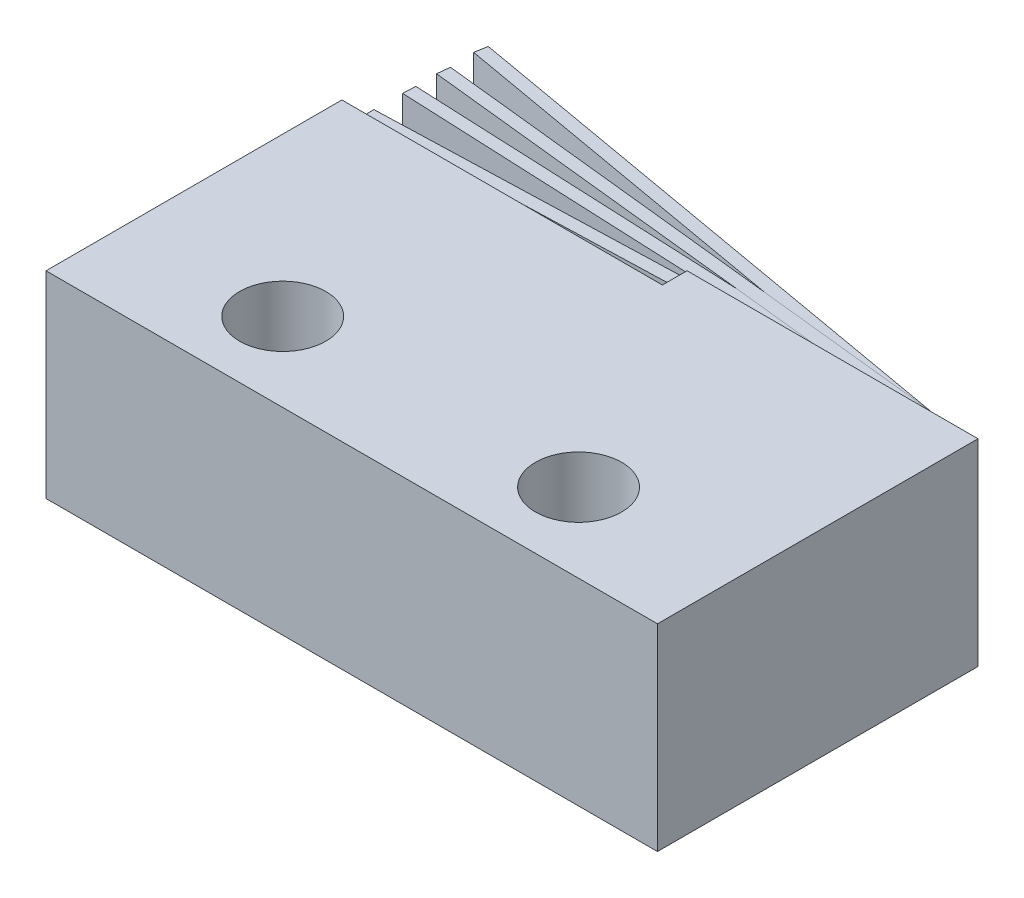
ISO-10303-21;
HEADER;
FILE_DESCRIPTION(('STEP AP214'),'2;1');
FILE_NAME('part.step','',(''),(''),'','','');
FILE_SCHEMA(('AUTOMOTIVE_DESIGN { 1 0 10303 214 1 1 1 1 }'));
ENDSEC;
DATA;
#1=APPLICATION_CONTEXT('core data for automotive mechanical design processes');
#2=APPLICATION_PROTOCOL_DEFINITION('international standard','automotive_design',2000,#1);
#3=PRODUCT_CONTEXT('',#1,'mechanical');
#4=PRODUCT('Part','Part','',(#3));
#5=PRODUCT_RELATED_PRODUCT_CATEGORY('part','',(#4));
#6=PRODUCT_DEFINITION_FORMATION('','',#4);
#7=PRODUCT_DEFINITION_CONTEXT('part definition',#1,'design');
#8=PRODUCT_DEFINITION('design','',#6,#7);
#9=PRODUCT_DEFINITION_SHAPE('','',#8);
#10=(LENGTH_UNIT() NAMED_UNIT(*) SI_UNIT(.MILLI.,.METRE.));
#11=(NAMED_UNIT(*) PLANE_ANGLE_UNIT() SI_UNIT($,.RADIAN.));
#12=(NAMED_UNIT(*) SI_UNIT($,.STERADIAN.) SOLID_ANGLE_UNIT());
#13=UNCERTAINTY_MEASURE_WITH_UNIT(LENGTH_MEASURE(1.E-05),#10,'distance_accuracy_value','');
#14=(GEOMETRIC_REPRESENTATION_CONTEXT(3) GLOBAL_UNCERTAINTY_ASSIGNED_CONTEXT((#13)) GLOBAL_UNIT_ASSIGNED_CONTEXT((#10,
#11,#12)) REPRESENTATION_CONTEXT('',''));
#15=CARTESIAN_POINT('',(0.,0.,0.));
#16=DIRECTION('',(0.,0.,1.));
#17=DIRECTION('',(1.,0.,0.));
#18=AXIS2_PLACEMENT_3D('',#15,#16,#17);
#19=CARTESIAN_POINT('',(-2.38125,1.5875,-10.715625));
#20=DIRECTION('',(0.999484869317121,0.,-0.032093550849632));
#21=DIRECTION('',(-0.032093550849632,0.,-0.999484869317121));
#22=AXIS2_PLACEMENT_3D('',#19,#20,#21);
#23=PLANE('',#22);
#24=DIRECTION('',(-0.032093550849632,0.,-0.999484869317121));
#25=VECTOR('',#24,1.);
#26=CARTESIAN_POINT('',(-2.38125,5.55625,-10.715625));
#27=LINE('',#26,#25);
#28=CARTESIAN_POINT('',(-2.38125,5.55625,-10.715625));
#29=VERTEX_POINT('',#28);
#30=CARTESIAN_POINT('',(-2.39429281906529,5.55625,-11.1218156508905));
#31=VERTEX_POINT('',#30);
#32=EDGE_CURVE('E411',#29,#31,#27,.T.);
#33=ORIENTED_EDGE('',*,*,#32,.F.);
#34=DIRECTION('',(0.,1.,0.));
#35=VECTOR('',#34,1.);
#36=CARTESIAN_POINT('',(-2.38125,1.5875,-10.715625));
#37=LINE('',#36,#35);
#38=CARTESIAN_POINT('',(-2.38125,1.5875,-10.715625));
#39=VERTEX_POINT('',#38);
#40=EDGE_CURVE('E12',#39,#29,#37,.T.);
#41=ORIENTED_EDGE('',*,*,#40,.F.);
#42=DIRECTION('',(-0.032093550849632,0.,-0.999484869317121));
#43=VECTOR('',#42,1.);
#44=CARTESIAN_POINT('',(-2.38125,1.5875,-10.715625));
#45=LINE('',#44,#43);
#46=CARTESIAN_POINT('',(-2.39429281906529,1.5875,-11.1218156508905));
#47=VERTEX_POINT('',#46);
#48=EDGE_CURVE('E413',#39,#47,#45,.T.);
#49=ORIENTED_EDGE('',*,*,#48,.T.);
#50=DIRECTION('',(0.,1.,0.));
#51=VECTOR('',#50,1.);
#52=CARTESIAN_POINT('',(-2.39429281906529,1.5875,-11.1218156508905));
#53=LINE('',#52,#51);
#54=EDGE_CURVE('E374',#47,#31,#53,.T.);
#55=ORIENTED_EDGE('',*,*,#54,.T.);
#56=EDGE_LOOP('',(#33,#41,#49,#55));
#57=FACE_BOUND('',#56,.T.);
#58=ADVANCED_FACE('F371',(#57),#23,.T.);
#59=CARTESIAN_POINT('',(-2.38125,1.5875,-10.715625));
#60=DIRECTION('',(0.0320935508496321,0.,0.999484869317121));
#61=DIRECTION('',(0.999484869317121,0.,-0.0320935508496321));
#62=AXIS2_PLACEMENT_3D('',#59,#60,#61);
#63=PLANE('',#62);
#64=DIRECTION('',(0.999484869317121,0.,-0.032093550849632));
#65=VECTOR('',#64,1.);
#66=CARTESIAN_POINT('',(-2.38125,5.55625,-10.715625));
#67=LINE('',#66,#65);
#68=CARTESIAN_POINT('',(-19.685,5.55625,-10.16));
#69=VERTEX_POINT('',#68);
#70=EDGE_CURVE('E428',#69,#29,#67,.T.);
#71=ORIENTED_EDGE('',*,*,#70,.F.);
#72=DIRECTION('',(0.,1.,0.));
#73=VECTOR('',#72,1.);
#74=CARTESIAN_POINT('',(-19.685,1.5875,-10.16));
#75=LINE('',#74,#73);
#76=CARTESIAN_POINT('',(-19.685,1.5875,-10.16));
#77=VERTEX_POINT('',#76);
#78=EDGE_CURVE('E379',#77,#69,#75,.T.);
#79=ORIENTED_EDGE('',*,*,#78,.F.);
#80=DIRECTION('',(0.999484869317121,0.,-0.032093550849632));
#81=VECTOR('',#80,1.);
#82=CARTESIAN_POINT('',(-2.38125,1.5875,-10.715625));
#83=LINE('',#82,#81);
#84=EDGE_CURVE('E418',#77,#39,#83,.T.);
#85=ORIENTED_EDGE('',*,*,#84,.T.);
#86=ORIENTED_EDGE('',*,*,#40,.T.);
#87=EDGE_LOOP('',(#71,#79,#85,#86));
#88=FACE_BOUND('',#87,.T.);
#89=ADVANCED_FACE('F443',(#88),#63,.T.);
#90=CARTESIAN_POINT('',(-19.685,1.5875,-10.16));
#91=DIRECTION('',(-0.999484869317121,0.,0.0320935508496286));
#92=DIRECTION('',(0.0320935508496286,0.,0.999484869317121));
#93=AXIS2_PLACEMENT_3D('',#90,#91,#92);
#94=PLANE('',#93);
#95=DIRECTION('',(0.0320935508496286,0.,0.999484869317121));
#96=VECTOR('',#95,1.);
#97=CARTESIAN_POINT('',(-19.685,5.55625,-10.16));
#98=LINE('',#97,#96);
#99=CARTESIAN_POINT('',(-19.6980428190653,5.55625,-10.5661906508905));
#100=VERTEX_POINT('',#99);
#101=EDGE_CURVE('E425',#100,#69,#98,.T.);
#102=ORIENTED_EDGE('',*,*,#101,.F.);
#103=DIRECTION('',(0.,1.,0.));
#104=VECTOR('',#103,1.);
#105=CARTESIAN_POINT('',(-19.6980428190653,1.5875,-10.5661906508905));
#106=LINE('',#105,#104);
#107=CARTESIAN_POINT('',(-19.6980428190653,1.5875,-10.5661906508905));
#108=VERTEX_POINT('',#107);
#109=EDGE_CURVE('E417',#108,#100,#106,.T.);
#110=ORIENTED_EDGE('',*,*,#109,.F.);
#111=DIRECTION('',(0.0320935508496286,0.,0.999484869317121));
#112=VECTOR('',#111,1.);
#113=CARTESIAN_POINT('',(-19.685,1.5875,-10.16));
#114=LINE('',#113,#112);
#115=EDGE_CURVE('E436',#108,#77,#114,.T.);
#116=ORIENTED_EDGE('',*,*,#115,.T.);
#117=ORIENTED_EDGE('',*,*,#78,.T.);
#118=EDGE_LOOP('',(#102,#110,#116,#117));
#119=FACE_BOUND('',#118,.T.);
#120=ADVANCED_FACE('F440',(#119),#94,.T.);
#121=CARTESIAN_POINT('',(-2.39429281906529,1.5875,-11.1218156508905));
#122=DIRECTION('',(-0.0320935508496319,0.,-0.999484869317121));
#123=DIRECTION('',(-0.999484869317121,0.,0.0320935508496319));
#124=AXIS2_PLACEMENT_3D('',#121,#122,#123);
#125=PLANE('',#124);
#126=DIRECTION('',(-0.999484869317121,0.,0.0320935508496319));
#127=VECTOR('',#126,1.);
#128=CARTESIAN_POINT('',(-2.39429281906529,5.55625,-11.1218156508905));
#129=LINE('',#128,#127);
#130=EDGE_CURVE('E420',#31,#100,#129,.T.);
#131=ORIENTED_EDGE('',*,*,#130,.F.);
#132=ORIENTED_EDGE('',*,*,#54,.F.);
#133=DIRECTION('',(-0.999484869317121,0.,0.0320935508496319));
#134=VECTOR('',#133,1.);
#135=CARTESIAN_POINT('',(-2.39429281906529,1.5875,-11.1218156508905));
#136=LINE('',#135,#134);
#137=EDGE_CURVE('E434',#47,#108,#136,.T.);
#138=ORIENTED_EDGE('',*,*,#137,.T.);
#139=ORIENTED_EDGE('',*,*,#109,.T.);
#140=EDGE_LOOP('',(#131,#132,#138,#139));
#141=FACE_BOUND('',#140,.T.);
#142=ADVANCED_FACE('F421',(#141),#125,.T.);
#143=CARTESIAN_POINT('',(-2.39429281906529,1.5875,-11.1218156508905));
#144=DIRECTION('',(0.,1.,0.));
#145=DIRECTION('',(0.,0.,1.));
#146=AXIS2_PLACEMENT_3D('',#143,#144,#145);
#147=PLANE('',#146);
#148=ORIENTED_EDGE('',*,*,#48,.F.);
#149=ORIENTED_EDGE('',*,*,#84,.F.);
#150=ORIENTED_EDGE('',*,*,#115,.F.);
#151=ORIENTED_EDGE('',*,*,#137,.F.);
#152=EDGE_LOOP('',(#148,#149,#150,#151));
#153=FACE_BOUND('',#152,.T.);
#154=ADVANCED_FACE('F445',(#153),#147,.F.);
#155=CARTESIAN_POINT('',(-2.39429281906529,5.55625,-11.1218156508905));
#156=DIRECTION('',(0.,1.,0.));
#157=DIRECTION('',(0.,0.,1.));
#158=AXIS2_PLACEMENT_3D('',#155,#156,#157);
#159=PLANE('',#158);
#160=ORIENTED_EDGE('',*,*,#32,.T.);
#161=ORIENTED_EDGE('',*,*,#130,.T.);
#162=ORIENTED_EDGE('',*,*,#101,.T.);
#163=ORIENTED_EDGE('',*,*,#70,.T.);
#164=EDGE_LOOP('',(#160,#161,#162,#163));
#165=FACE_BOUND('',#164,.T.);
#166=ADVANCED_FACE('F427',(#165),#159,.T.);
#167=CLOSED_SHELL('',(#58,#89,#120,#142,#154,#166));
#168=MANIFOLD_SOLID_BREP('B2',#167);
#169=CARTESIAN_POINT('',(-2.38125,1.5875,-10.715625));
#170=DIRECTION('',(0.994288429664584,0.,0.106726372725466));
#171=DIRECTION('',(0.106726372725466,0.,-0.994288429664584));
#172=AXIS2_PLACEMENT_3D('',#169,#170,#171);
#173=PLANE('',#172);
#174=DIRECTION('',(0.106726372725466,0.,-0.994288429664584));
#175=VECTOR('',#174,1.);
#176=CARTESIAN_POINT('',(-2.38125,5.55625,-10.715625));
#177=LINE('',#176,#175);
#178=CARTESIAN_POINT('',(-2.38125,5.55625,-10.715625));
#179=VERTEX_POINT('',#178);
#180=CARTESIAN_POINT('',(-2.33787640212437,5.55625,-11.1197038178157));
#181=VERTEX_POINT('',#180);
#182=EDGE_CURVE('E532',#179,#181,#177,.T.);
#183=ORIENTED_EDGE('',*,*,#182,.F.);
#184=DIRECTION('',(0.,1.,0.));
#185=VECTOR('',#184,1.);
#186=CARTESIAN_POINT('',(-2.38125,1.5875,-10.715625));
#187=LINE('',#186,#185);
#188=CARTESIAN_POINT('',(-2.38125,1.5875,-10.715625));
#189=VERTEX_POINT('',#188);
#190=EDGE_CURVE('E369',#189,#179,#187,.T.);
#191=ORIENTED_EDGE('',*,*,#190,.F.);
#192=DIRECTION('',(0.106726372725466,0.,-0.994288429664584));
#193=VECTOR('',#192,1.);
#194=CARTESIAN_POINT('',(-2.38125,1.5875,-10.715625));
#195=LINE('',#194,#193);
#196=CARTESIAN_POINT('',(-2.33787640212437,1.5875,-11.1197038178157));
#197=VERTEX_POINT('',#196);
#198=EDGE_CURVE('E534',#189,#197,#195,.T.);
#199=ORIENTED_EDGE('',*,*,#198,.T.);
#200=DIRECTION('',(0.,1.,0.));
#201=VECTOR('',#200,1.);
#202=CARTESIAN_POINT('',(-2.33787640212437,1.5875,-11.1197038178157));
#203=LINE('',#202,#201);
#204=EDGE_CURVE('E495',#197,#181,#203,.T.);
#205=ORIENTED_EDGE('',*,*,#204,.T.);
#206=EDGE_LOOP('',(#183,#191,#199,#205));
#207=FACE_BOUND('',#206,.T.);
#208=ADVANCED_FACE('F492',(#207),#173,.T.);
#209=CARTESIAN_POINT('',(-2.38125,1.5875,-10.715625));
#210=DIRECTION('',(-0.106726372725465,0.,0.994288429664584));
#211=DIRECTION('',(0.994288429664585,0.,0.106726372725465));
#212=AXIS2_PLACEMENT_3D('',#209,#210,#211);
#213=PLANE('',#212);
#214=DIRECTION('',(0.994288429664584,0.,0.106726372725465));
#215=VECTOR('',#214,1.);
#216=CARTESIAN_POINT('',(-2.38125,5.55625,-10.715625));
#217=LINE('',#216,#215);
#218=CARTESIAN_POINT('',(-19.685,5.55625,-12.573));
#219=VERTEX_POINT('',#218);
#220=EDGE_CURVE('E549',#219,#179,#217,.T.);
#221=ORIENTED_EDGE('',*,*,#220,.F.);
#222=DIRECTION('',(0.,1.,0.));
#223=VECTOR('',#222,1.);
#224=CARTESIAN_POINT('',(-19.685,1.5875,-12.573));
#225=LINE('',#224,#223);
#226=CARTESIAN_POINT('',(-19.685,1.5875,-12.573));
#227=VERTEX_POINT('',#226);
#228=EDGE_CURVE('E500',#227,#219,#225,.T.);
#229=ORIENTED_EDGE('',*,*,#228,.F.);
#230=DIRECTION('',(0.994288429664584,0.,0.106726372725465));
#231=VECTOR('',#230,1.);
#232=CARTESIAN_POINT('',(-2.38125,1.5875,-10.715625));
#233=LINE('',#232,#231);
#234=EDGE_CURVE('E539',#227,#189,#233,.T.);
#235=ORIENTED_EDGE('',*,*,#234,.T.);
#236=ORIENTED_EDGE('',*,*,#190,.T.);
#237=EDGE_LOOP('',(#221,#229,#235,#236));
#238=FACE_BOUND('',#237,.T.);
#239=ADVANCED_FACE('F564',(#238),#213,.T.);
#240=CARTESIAN_POINT('',(-19.685,1.5875,-12.573));
#241=DIRECTION('',(-0.994288429664584,0.,-0.106726372725468));
#242=DIRECTION('',(-0.106726372725468,0.,0.994288429664584));
#243=AXIS2_PLACEMENT_3D('',#240,#241,#242);
#244=PLANE('',#243);
#245=DIRECTION('',(-0.106726372725468,0.,0.994288429664584));
#246=VECTOR('',#245,1.);
#247=CARTESIAN_POINT('',(-19.685,5.55625,-12.573));
#248=LINE('',#247,#246);
#249=CARTESIAN_POINT('',(-19.6416264021244,5.55625,-12.9770788178157));
#250=VERTEX_POINT('',#249);
#251=EDGE_CURVE('E546',#250,#219,#248,.T.);
#252=ORIENTED_EDGE('',*,*,#251,.F.);
#253=DIRECTION('',(0.,1.,0.));
#254=VECTOR('',#253,1.);
#255=CARTESIAN_POINT('',(-19.6416264021244,1.5875,-12.9770788178157));
#256=LINE('',#255,#254);
#257=CARTESIAN_POINT('',(-19.6416264021244,1.5875,-12.9770788178157));
#258=VERTEX_POINT('',#257);
#259=EDGE_CURVE('E538',#258,#250,#256,.T.);
#260=ORIENTED_EDGE('',*,*,#259,.F.);
#261=DIRECTION('',(-0.106726372725468,0.,0.994288429664584));
#262=VECTOR('',#261,1.);
#263=CARTESIAN_POINT('',(-19.685,1.5875,-12.573));
#264=LINE('',#263,#262);
#265=EDGE_CURVE('E557',#258,#227,#264,.T.);
#266=ORIENTED_EDGE('',*,*,#265,.T.);
#267=ORIENTED_EDGE('',*,*,#228,.T.);
#268=EDGE_LOOP('',(#252,#260,#266,#267));
#269=FACE_BOUND('',#268,.T.);
#270=ADVANCED_FACE('F561',(#269),#244,.T.);
#271=CARTESIAN_POINT('',(-2.33787640212437,1.5875,-11.1197038178157));
#272=DIRECTION('',(0.106726372725465,0.,-0.994288429664584));
#273=DIRECTION('',(-0.994288429664585,0.,-0.106726372725465));
#274=AXIS2_PLACEMENT_3D('',#271,#272,#273);
#275=PLANE('',#274);
#276=DIRECTION('',(-0.994288429664584,0.,-0.106726372725465));
#277=VECTOR('',#276,1.);
#278=CARTESIAN_POINT('',(-2.33787640212437,5.55625,-11.1197038178157));
#279=LINE('',#278,#277);
#280=EDGE_CURVE('E541',#181,#250,#279,.T.);
#281=ORIENTED_EDGE('',*,*,#280,.F.);
#282=ORIENTED_EDGE('',*,*,#204,.F.);
#283=DIRECTION('',(-0.994288429664584,0.,-0.106726372725465));
#284=VECTOR('',#283,1.);
#285=CARTESIAN_POINT('',(-2.33787640212437,1.5875,-11.1197038178157));
#286=LINE('',#285,#284);
#287=EDGE_CURVE('E555',#197,#258,#286,.T.);
#288=ORIENTED_EDGE('',*,*,#287,.T.);
#289=ORIENTED_EDGE('',*,*,#259,.T.);
#290=EDGE_LOOP('',(#281,#282,#288,#289));
#291=FACE_BOUND('',#290,.T.);
#292=ADVANCED_FACE('F542',(#291),#275,.T.);
#293=CARTESIAN_POINT('',(-2.33787640212437,1.5875,-11.1197038178157));
#294=DIRECTION('',(0.,1.,0.));
#295=DIRECTION('',(0.,0.,1.));
#296=AXIS2_PLACEMENT_3D('',#293,#294,#295);
#297=PLANE('',#296);
#298=ORIENTED_EDGE('',*,*,#198,.F.);
#299=ORIENTED_EDGE('',*,*,#234,.F.);
#300=ORIENTED_EDGE('',*,*,#265,.F.);
#301=ORIENTED_EDGE('',*,*,#287,.F.);
#302=EDGE_LOOP('',(#298,#299,#300,#301));
#303=FACE_BOUND('',#302,.T.);
#304=ADVANCED_FACE('F566',(#303),#297,.F.);
#305=CARTESIAN_POINT('',(-2.33787640212437,5.55625,-11.1197038178157));
#306=DIRECTION('',(0.,1.,0.));
#307=DIRECTION('',(0.,0.,1.));
#308=AXIS2_PLACEMENT_3D('',#305,#306,#307);
#309=PLANE('',#308);
#310=ORIENTED_EDGE('',*,*,#182,.T.);
#311=ORIENTED_EDGE('',*,*,#280,.T.);
#312=ORIENTED_EDGE('',*,*,#251,.T.);
#313=ORIENTED_EDGE('',*,*,#220,.T.);
#314=EDGE_LOOP('',(#310,#311,#312,#313));
#315=FACE_BOUND('',#314,.T.);
#316=ADVANCED_FACE('F548',(#315),#309,.T.);
#317=CLOSED_SHELL('',(#208,#239,#270,#292,#304,#316));
#318=MANIFOLD_SOLID_BREP('B6',#317);
#319=CARTESIAN_POINT('',(-2.38125,1.5875,-10.715625));
#320=DIRECTION('',(0.999023719235725,0.,0.0441770121717087));
#321=DIRECTION('',(0.0441770121717087,0.,-0.999023719235725));
#322=AXIS2_PLACEMENT_3D('',#319,#320,#321);
#323=PLANE('',#322);
#324=DIRECTION('',(0.0441770121717087,0.,-0.999023719235725));
#325=VECTOR('',#324,1.);
#326=CARTESIAN_POINT('',(-2.38125,5.55625,-10.715625));
#327=LINE('',#326,#325);
#328=CARTESIAN_POINT('',(-2.38125,5.55625,-10.715625));
#329=VERTEX_POINT('',#328);
#330=CARTESIAN_POINT('',(-2.36329646225342,5.55625,-11.1216282394974));
#331=VERTEX_POINT('',#330);
#332=EDGE_CURVE('E653',#329,#331,#327,.T.);
#333=ORIENTED_EDGE('',*,*,#332,.F.);
#334=DIRECTION('',(0.,1.,0.));
#335=VECTOR('',#334,1.);
#336=CARTESIAN_POINT('',(-2.38125,1.5875,-10.715625));
#337=LINE('',#336,#335);
#338=CARTESIAN_POINT('',(-2.38125,1.5875,-10.715625));
#339=VERTEX_POINT('',#338);
#340=EDGE_CURVE('E490',#339,#329,#337,.T.);
#341=ORIENTED_EDGE('',*,*,#340,.F.);
#342=DIRECTION('',(0.0441770121717087,0.,-0.999023719235725));
#343=VECTOR('',#342,1.);
#344=CARTESIAN_POINT('',(-2.38125,1.5875,-10.715625));
#345=LINE('',#344,#343);
#346=CARTESIAN_POINT('',(-2.36329646225342,1.5875,-11.1216282394974));
#347=VERTEX_POINT('',#346);
#348=EDGE_CURVE('E655',#339,#347,#345,.T.);
#349=ORIENTED_EDGE('',*,*,#348,.T.);
#350=DIRECTION('',(0.,1.,0.));
#351=VECTOR('',#350,1.);
#352=CARTESIAN_POINT('',(-2.36329646225342,1.5875,-11.1216282394974));
#353=LINE('',#352,#351);
#354=EDGE_CURVE('E616',#347,#331,#353,.T.);
#355=ORIENTED_EDGE('',*,*,#354,.T.);
#356=EDGE_LOOP('',(#333,#341,#349,#355));
#357=FACE_BOUND('',#356,.T.);
#358=ADVANCED_FACE('F613',(#357),#323,.T.);
#359=CARTESIAN_POINT('',(-2.38125,1.5875,-10.715625));
#360=DIRECTION('',(-0.0441770121717084,0.,0.999023719235725));
#361=DIRECTION('',(0.999023719235725,0.,0.0441770121717084));
#362=AXIS2_PLACEMENT_3D('',#359,#360,#361);
#363=PLANE('',#362);
#364=DIRECTION('',(0.999023719235725,0.,0.0441770121717084));
#365=VECTOR('',#364,1.);
#366=CARTESIAN_POINT('',(-2.38125,5.55625,-10.715625));
#367=LINE('',#366,#365);
#368=CARTESIAN_POINT('',(-19.685,5.55625,-11.4808));
#369=VERTEX_POINT('',#368);
#370=EDGE_CURVE('E670',#369,#329,#367,.T.);
#371=ORIENTED_EDGE('',*,*,#370,.F.);
#372=DIRECTION('',(0.,1.,0.));
#373=VECTOR('',#372,1.);
#374=CARTESIAN_POINT('',(-19.685,1.5875,-11.4808));
#375=LINE('',#374,#373);
#376=CARTESIAN_POINT('',(-19.685,1.5875,-11.4808));
#377=VERTEX_POINT('',#376);
#378=EDGE_CURVE('E621',#377,#369,#375,.T.);
#379=ORIENTED_EDGE('',*,*,#378,.F.);
#380=DIRECTION('',(0.999023719235725,0.,0.0441770121717084));
#381=VECTOR('',#380,1.);
#382=CARTESIAN_POINT('',(-2.38125,1.5875,-10.715625));
#383=LINE('',#382,#381);
#384=EDGE_CURVE('E660',#377,#339,#383,.T.);
#385=ORIENTED_EDGE('',*,*,#384,.T.);
#386=ORIENTED_EDGE('',*,*,#340,.T.);
#387=EDGE_LOOP('',(#371,#379,#385,#386));
#388=FACE_BOUND('',#387,.T.);
#389=ADVANCED_FACE('F685',(#388),#363,.T.);
#390=CARTESIAN_POINT('',(-19.685,1.5875,-11.4808));
#391=DIRECTION('',(-0.999023719235725,0.,-0.0441770121717053));
#392=DIRECTION('',(-0.0441770121717053,0.,0.999023719235725));
#393=AXIS2_PLACEMENT_3D('',#390,#391,#392);
#394=PLANE('',#393);
#395=DIRECTION('',(-0.0441770121717053,0.,0.999023719235725));
#396=VECTOR('',#395,1.);
#397=CARTESIAN_POINT('',(-19.685,5.55625,-11.4808));
#398=LINE('',#397,#396);
#399=CARTESIAN_POINT('',(-19.6670464622534,5.55625,-11.8868032394974));
#400=VERTEX_POINT('',#399);
#401=EDGE_CURVE('E667',#400,#369,#398,.T.);
#402=ORIENTED_EDGE('',*,*,#401,.F.);
#403=DIRECTION('',(0.,1.,0.));
#404=VECTOR('',#403,1.);
#405=CARTESIAN_POINT('',(-19.6670464622534,1.5875,-11.8868032394974));
#406=LINE('',#405,#404);
#407=CARTESIAN_POINT('',(-19.6670464622534,1.5875,-11.8868032394974));
#408=VERTEX_POINT('',#407);
#409=EDGE_CURVE('E659',#408,#400,#406,.T.);
#410=ORIENTED_EDGE('',*,*,#409,.F.);
#411=DIRECTION('',(-0.0441770121717053,0.,0.999023719235725));
#412=VECTOR('',#411,1.);
#413=CARTESIAN_POINT('',(-19.685,1.5875,-11.4808));
#414=LINE('',#413,#412);
#415=EDGE_CURVE('E678',#408,#377,#414,.T.);
#416=ORIENTED_EDGE('',*,*,#415,.T.);
#417=ORIENTED_EDGE('',*,*,#378,.T.);
#418=EDGE_LOOP('',(#402,#410,#416,#417));
#419=FACE_BOUND('',#418,.T.);
#420=ADVANCED_FACE('F682',(#419),#394,.T.);
#421=CARTESIAN_POINT('',(-2.36329646225342,1.5875,-11.1216282394974));
#422=DIRECTION('',(0.0441770121717085,0.,-0.999023719235725));
#423=DIRECTION('',(-0.999023719235725,0.,-0.0441770121717085));
#424=AXIS2_PLACEMENT_3D('',#421,#422,#423);
#425=PLANE('',#424);
#426=DIRECTION('',(-0.999023719235725,0.,-0.0441770121717085));
#427=VECTOR('',#426,1.);
#428=CARTESIAN_POINT('',(-2.36329646225342,5.55625,-11.1216282394974));
#429=LINE('',#428,#427);
#430=EDGE_CURVE('E662',#331,#400,#429,.T.);
#431=ORIENTED_EDGE('',*,*,#430,.F.);
#432=ORIENTED_EDGE('',*,*,#354,.F.);
#433=DIRECTION('',(-0.999023719235725,0.,-0.0441770121717085));
#434=VECTOR('',#433,1.);
#435=CARTESIAN_POINT('',(-2.36329646225342,1.5875,-11.1216282394974));
#436=LINE('',#435,#434);
#437=EDGE_CURVE('E676',#347,#408,#436,.T.);
#438=ORIENTED_EDGE('',*,*,#437,.T.);
#439=ORIENTED_EDGE('',*,*,#409,.T.);
#440=EDGE_LOOP('',(#431,#432,#438,#439));
#441=FACE_BOUND('',#440,.T.);
#442=ADVANCED_FACE('F663',(#441),#425,.T.);
#443=CARTESIAN_POINT('',(-2.36329646225342,1.5875,-11.1216282394974));
#444=DIRECTION('',(0.,1.,0.));
#445=DIRECTION('',(0.,0.,1.));
#446=AXIS2_PLACEMENT_3D('',#443,#444,#445);
#447=PLANE('',#446);
#448=ORIENTED_EDGE('',*,*,#348,.F.);
#449=ORIENTED_EDGE('',*,*,#384,.F.);
#450=ORIENTED_EDGE('',*,*,#415,.F.);
#451=ORIENTED_EDGE('',*,*,#437,.F.);
#452=EDGE_LOOP('',(#448,#449,#450,#451));
#453=FACE_BOUND('',#452,.T.);
#454=ADVANCED_FACE('F687',(#453),#447,.F.);
#455=CARTESIAN_POINT('',(-2.36329646225342,5.55625,-11.1216282394974));
#456=DIRECTION('',(0.,1.,0.));
#457=DIRECTION('',(0.,0.,1.));
#458=AXIS2_PLACEMENT_3D('',#455,#456,#457);
#459=PLANE('',#458);
#460=ORIENTED_EDGE('',*,*,#332,.T.);
#461=ORIENTED_EDGE('',*,*,#430,.T.);
#462=ORIENTED_EDGE('',*,*,#401,.T.);
#463=ORIENTED_EDGE('',*,*,#370,.T.);
#464=EDGE_LOOP('',(#460,#461,#462,#463));
#465=FACE_BOUND('',#464,.T.);
#466=ADVANCED_FACE('F669',(#465),#459,.T.);
#467=CLOSED_SHELL('',(#358,#389,#420,#442,#454,#466));
#468=MANIFOLD_SOLID_BREP('B363',#467);
#469=CARTESIAN_POINT('',(-2.38125,1.5875,-10.715625));
#470=DIRECTION('',(0.984807198170495,0.,0.173651324301256));
#471=DIRECTION('',(0.173651324301256,0.,-0.984807198170495));
#472=AXIS2_PLACEMENT_3D('',#469,#470,#471);
#473=PLANE('',#472);
#474=DIRECTION('',(0.173651324301256,0.,-0.984807198170495));
#475=VECTOR('',#474,1.);
#476=CARTESIAN_POINT('',(-2.38125,5.55625,-10.715625));
#477=LINE('',#476,#475);
#478=CARTESIAN_POINT('',(-2.38125,5.55625,-10.715625));
#479=VERTEX_POINT('',#478);
#480=CARTESIAN_POINT('',(-2.31067810180397,5.55625,-11.1158506453365));
#481=VERTEX_POINT('',#480);
#482=EDGE_CURVE('E773',#479,#481,#477,.T.);
#483=ORIENTED_EDGE('',*,*,#482,.F.);
#484=DIRECTION('',(0.,1.,0.));
#485=VECTOR('',#484,1.);
#486=CARTESIAN_POINT('',(-2.38125,1.5875,-10.715625));
#487=LINE('',#486,#485);
#488=CARTESIAN_POINT('',(-2.38125,1.5875,-10.715625));
#489=VERTEX_POINT('',#488);
#490=EDGE_CURVE('E611',#489,#479,#487,.T.);
#491=ORIENTED_EDGE('',*,*,#490,.F.);
#492=DIRECTION('',(0.173651324301256,0.,-0.984807198170495));
#493=VECTOR('',#492,1.);
#494=CARTESIAN_POINT('',(-2.38125,1.5875,-10.715625));
#495=LINE('',#494,#493);
#496=CARTESIAN_POINT('',(-2.31067810180397,1.5875,-11.1158506453365));
#497=VERTEX_POINT('',#496);
#498=EDGE_CURVE('E775',#489,#497,#495,.T.);
#499=ORIENTED_EDGE('',*,*,#498,.T.);
#500=DIRECTION('',(0.,1.,0.));
#501=VECTOR('',#500,1.);
#502=CARTESIAN_POINT('',(-2.31067810180397,1.5875,-11.1158506453365));
#503=LINE('',#502,#501);
#504=EDGE_CURVE('E736',#497,#481,#503,.T.);
#505=ORIENTED_EDGE('',*,*,#504,.T.);
#506=EDGE_LOOP('',(#483,#491,#499,#505));
#507=FACE_BOUND('',#506,.T.);
#508=ADVANCED_FACE('F733',(#507),#473,.T.);
#509=CARTESIAN_POINT('',(-2.38125,1.5875,-10.715625));
#510=DIRECTION('',(-0.173651324301256,0.,0.984807198170495));
#511=DIRECTION('',(0.984807198170495,0.,0.173651324301256));
#512=AXIS2_PLACEMENT_3D('',#509,#510,#511);
#513=PLANE('',#512);
#514=DIRECTION('',(0.984807198170495,0.,0.173651324301256));
#515=VECTOR('',#514,1.);
#516=CARTESIAN_POINT('',(-2.38125,5.55625,-10.715625));
#517=LINE('',#516,#515);
#518=CARTESIAN_POINT('',(-19.685,5.55625,-13.7668));
#519=VERTEX_POINT('',#518);
#520=EDGE_CURVE('E790',#519,#479,#517,.T.);
#521=ORIENTED_EDGE('',*,*,#520,.F.);
#522=DIRECTION('',(0.,1.,0.));
#523=VECTOR('',#522,1.);
#524=CARTESIAN_POINT('',(-19.685,1.5875,-13.7668));
#525=LINE('',#524,#523);
#526=CARTESIAN_POINT('',(-19.685,1.5875,-13.7668));
#527=VERTEX_POINT('',#526);
#528=EDGE_CURVE('E741',#527,#519,#525,.T.);
#529=ORIENTED_EDGE('',*,*,#528,.F.);
#530=DIRECTION('',(0.984807198170495,0.,0.173651324301256));
#531=VECTOR('',#530,1.);
#532=CARTESIAN_POINT('',(-2.38125,1.5875,-10.715625));
#533=LINE('',#532,#531);
#534=EDGE_CURVE('E780',#527,#489,#533,.T.);
#535=ORIENTED_EDGE('',*,*,#534,.T.);
#536=ORIENTED_EDGE('',*,*,#490,.T.);
#537=EDGE_LOOP('',(#521,#529,#535,#536));
#538=FACE_BOUND('',#537,.T.);
#539=ADVANCED_FACE('F805',(#538),#513,.T.);
#540=CARTESIAN_POINT('',(-19.685,1.5875,-13.7668));
#541=DIRECTION('',(-0.984807198170495,0.,-0.173651324301254));
#542=DIRECTION('',(-0.173651324301254,0.,0.984807198170495));
#543=AXIS2_PLACEMENT_3D('',#540,#541,#542);
#544=PLANE('',#543);
#545=DIRECTION('',(-0.173651324301254,0.,0.984807198170495));
#546=VECTOR('',#545,1.);
#547=CARTESIAN_POINT('',(-19.685,5.55625,-13.7668));
#548=LINE('',#547,#546);
#549=CARTESIAN_POINT('',(-19.614428101804,5.55625,-14.1670256453365));
#550=VERTEX_POINT('',#549);
#551=EDGE_CURVE('E787',#550,#519,#548,.T.);
#552=ORIENTED_EDGE('',*,*,#551,.F.);
#553=DIRECTION('',(0.,1.,0.));
#554=VECTOR('',#553,1.);
#555=CARTESIAN_POINT('',(-19.614428101804,1.5875,-14.1670256453365));
#556=LINE('',#555,#554);
#557=CARTESIAN_POINT('',(-19.614428101804,1.5875,-14.1670256453365));
#558=VERTEX_POINT('',#557);
#559=EDGE_CURVE('E779',#558,#550,#556,.T.);
#560=ORIENTED_EDGE('',*,*,#559,.F.);
#561=DIRECTION('',(-0.173651324301254,0.,0.984807198170495));
#562=VECTOR('',#561,1.);
#563=CARTESIAN_POINT('',(-19.685,1.5875,-13.7668));
#564=LINE('',#563,#562);
#565=EDGE_CURVE('E798',#558,#527,#564,.T.);
#566=ORIENTED_EDGE('',*,*,#565,.T.);
#567=ORIENTED_EDGE('',*,*,#528,.T.);
#568=EDGE_LOOP('',(#552,#560,#566,#567));
#569=FACE_BOUND('',#568,.T.);
#570=ADVANCED_FACE('F802',(#569),#544,.T.);
#571=CARTESIAN_POINT('',(-2.31067810180397,1.5875,-11.1158506453365));
#572=DIRECTION('',(0.173651324301256,0.,-0.984807198170495));
#573=DIRECTION('',(-0.984807198170495,0.,-0.173651324301256));
#574=AXIS2_PLACEMENT_3D('',#571,#572,#573);
#575=PLANE('',#574);
#576=DIRECTION('',(-0.984807198170495,0.,-0.173651324301256));
#577=VECTOR('',#576,1.);
#578=CARTESIAN_POINT('',(-2.31067810180397,5.55625,-11.1158506453365));
#579=LINE('',#578,#577);
#580=EDGE_CURVE('E782',#481,#550,#579,.T.);
#581=ORIENTED_EDGE('',*,*,#580,.F.);
#582=ORIENTED_EDGE('',*,*,#504,.F.);
#583=DIRECTION('',(-0.984807198170495,0.,-0.173651324301256));
#584=VECTOR('',#583,1.);
#585=CARTESIAN_POINT('',(-2.31067810180397,1.5875,-11.1158506453365));
#586=LINE('',#585,#584);
#587=EDGE_CURVE('E796',#497,#558,#586,.T.);
#588=ORIENTED_EDGE('',*,*,#587,.T.);
#589=ORIENTED_EDGE('',*,*,#559,.T.);
#590=EDGE_LOOP('',(#581,#582,#588,#589));
#591=FACE_BOUND('',#590,.T.);
#592=ADVANCED_FACE('F783',(#591),#575,.T.);
#593=CARTESIAN_POINT('',(-2.38125,1.5875,-10.715625));
#594=DIRECTION('',(0.,1.,0.));
#595=DIRECTION('',(0.,0.,1.));
#596=AXIS2_PLACEMENT_3D('',#593,#594,#595);
#597=PLANE('',#596);
#598=ORIENTED_EDGE('',*,*,#498,.F.);
#599=ORIENTED_EDGE('',*,*,#534,.F.);
#600=ORIENTED_EDGE('',*,*,#565,.F.);
#601=ORIENTED_EDGE('',*,*,#587,.F.);
#602=EDGE_LOOP('',(#598,#599,#600,#601));
#603=FACE_BOUND('',#602,.T.);
#604=ADVANCED_FACE('F807',(#603),#597,.F.);
#605=CARTESIAN_POINT('',(-2.38125,5.55625,-10.715625));
#606=DIRECTION('',(0.,1.,0.));
#607=DIRECTION('',(0.,0.,1.));
#608=AXIS2_PLACEMENT_3D('',#605,#606,#607);
#609=PLANE('',#608);
#610=ORIENTED_EDGE('',*,*,#482,.T.);
#611=ORIENTED_EDGE('',*,*,#580,.T.);
#612=ORIENTED_EDGE('',*,*,#551,.T.);
#613=ORIENTED_EDGE('',*,*,#520,.T.);
#614=EDGE_LOOP('',(#610,#611,#612,#613));
#615=FACE_BOUND('',#614,.T.);
#616=ADVANCED_FACE('F789',(#615),#609,.T.);
#617=CLOSED_SHELL('',(#508,#539,#570,#592,#604,#616));
#618=MANIFOLD_SOLID_BREP('B484',#617);
#619=CARTESIAN_POINT('',(-19.685,6.35,-9.525));
#620=DIRECTION('',(0.,0.,1.));
#621=DIRECTION('',(1.,0.,0.));
#622=AXIS2_PLACEMENT_3D('',#619,#620,#621);
#623=PLANE('',#622);
#624=DIRECTION('',(0.,1.,0.));
#625=VECTOR('',#624,1.);
#626=CARTESIAN_POINT('',(-9.36625,-9.39982330286055,-9.52499999999999));
#627=LINE('',#626,#625);
#628=CARTESIAN_POINT('',(-9.36625,0.,-9.525));
#629=VERTEX_POINT('',#628);
#630=CARTESIAN_POINT('',(-9.36625,6.35,-9.52499999999999));
#631=VERTEX_POINT('',#630);
#632=EDGE_CURVE('E861',#629,#631,#627,.T.);
#633=ORIENTED_EDGE('',*,*,#632,.F.);
#634=DIRECTION('',(-1.,0.,0.));
#635=VECTOR('',#634,1.);
#636=CARTESIAN_POINT('',(-19.685,0.,-9.525));
#637=LINE('',#636,#635);
#638=CARTESIAN_POINT('',(-19.685,0.,-9.525));
#639=VERTEX_POINT('',#638);
#640=EDGE_CURVE('E958',#629,#639,#637,.T.);
#641=ORIENTED_EDGE('',*,*,#640,.T.);
#642=DIRECTION('',(0.,-1.,0.));
#643=VECTOR('',#642,1.);
#644=CARTESIAN_POINT('',(-19.685,6.35,-9.525));
#645=LINE('',#644,#643);
#646=CARTESIAN_POINT('',(-19.685,6.35,-9.525));
#647=VERTEX_POINT('',#646);
#648=EDGE_CURVE('E965',#647,#639,#645,.T.);
#649=ORIENTED_EDGE('',*,*,#648,.F.);
#650=DIRECTION('',(-1.,0.,0.));
#651=VECTOR('',#650,1.);
#652=CARTESIAN_POINT('',(-19.685,6.35,-9.525));
#653=LINE('',#652,#651);
#654=EDGE_CURVE('E868',#631,#647,#653,.T.);
#655=ORIENTED_EDGE('',*,*,#654,.F.);
#656=EDGE_LOOP('',(#633,#641,#649,#655));
#657=FACE_BOUND('',#656,.T.);
#658=ADVANCED_FACE('F844',(#657),#623,.F.);
#659=CARTESIAN_POINT('',(-19.685,6.35,-9.525));
#660=DIRECTION('',(1.,0.,0.));
#661=DIRECTION('',(0.,0.,-1.));
#662=AXIS2_PLACEMENT_3D('',#659,#660,#661);
#663=PLANE('',#662);
#664=DIRECTION('',(0.,0.,1.));
#665=VECTOR('',#664,1.);
#666=CARTESIAN_POINT('',(-19.685,0.,-9.525));
#667=LINE('',#666,#665);
#668=CARTESIAN_POINT('',(-19.685,0.,0.));
#669=VERTEX_POINT('',#668);
#670=EDGE_CURVE('E950',#639,#669,#667,.T.);
#671=ORIENTED_EDGE('',*,*,#670,.T.);
#672=DIRECTION('',(0.,-1.,0.));
#673=VECTOR('',#672,1.);
#674=CARTESIAN_POINT('',(-19.685,6.35,0.));
#675=LINE('',#674,#673);
#676=CARTESIAN_POINT('',(-19.685,6.35,0.));
#677=VERTEX_POINT('',#676);
#678=EDGE_CURVE('E731',#677,#669,#675,.T.);
#679=ORIENTED_EDGE('',*,*,#678,.F.);
#680=DIRECTION('',(0.,0.,1.));
#681=VECTOR('',#680,1.);
#682=CARTESIAN_POINT('',(-19.685,6.35,-9.525));
#683=LINE('',#682,#681);
#684=EDGE_CURVE('E961',#647,#677,#683,.T.);
#685=ORIENTED_EDGE('',*,*,#684,.F.);
#686=ORIENTED_EDGE('',*,*,#648,.T.);
#687=EDGE_LOOP('',(#671,#679,#685,#686));
#688=FACE_BOUND('',#687,.T.);
#689=ADVANCED_FACE('F846',(#688),#663,.F.);
#690=CARTESIAN_POINT('',(-19.685,6.35,0.));
#691=DIRECTION('',(0.,0.,-1.));
#692=DIRECTION('',(-1.,0.,0.));
#693=AXIS2_PLACEMENT_3D('',#690,#691,#692);
#694=PLANE('',#693);
#695=DIRECTION('',(1.,0.,0.));
#696=VECTOR('',#695,1.);
#697=CARTESIAN_POINT('',(-19.685,0.,0.));
#698=LINE('',#697,#696);
#699=CARTESIAN_POINT('',(0.,0.,0.));
#700=VERTEX_POINT('',#699);
#701=EDGE_CURVE('E955',#669,#700,#698,.T.);
#702=ORIENTED_EDGE('',*,*,#701,.T.);
#703=DIRECTION('',(0.,-1.,0.));
#704=VECTOR('',#703,1.);
#705=CARTESIAN_POINT('',(0.,6.35,0.));
#706=LINE('',#705,#704);
#707=CARTESIAN_POINT('',(0.,6.35,0.));
#708=VERTEX_POINT('',#707);
#709=EDGE_CURVE('E853',#708,#700,#706,.T.);
#710=ORIENTED_EDGE('',*,*,#709,.F.);
#711=DIRECTION('',(1.,0.,0.));
#712=VECTOR('',#711,1.);
#713=CARTESIAN_POINT('',(-19.685,6.35,0.));
#714=LINE('',#713,#712);
#715=EDGE_CURVE('E904',#677,#708,#714,.T.);
#716=ORIENTED_EDGE('',*,*,#715,.F.);
#717=ORIENTED_EDGE('',*,*,#678,.T.);
#718=EDGE_LOOP('',(#702,#710,#716,#717));
#719=FACE_BOUND('',#718,.T.);
#720=ADVANCED_FACE('F973',(#719),#694,.F.);
#721=CARTESIAN_POINT('',(0.,6.35,-9.525));
#722=DIRECTION('',(-1.,0.,0.));
#723=DIRECTION('',(0.,0.,1.));
#724=AXIS2_PLACEMENT_3D('',#721,#722,#723);
#725=PLANE('',#724);
#726=DIRECTION('',(0.,0.,-1.));
#727=VECTOR('',#726,1.);
#728=CARTESIAN_POINT('',(0.,0.,-9.525));
#729=LINE('',#728,#727);
#730=CARTESIAN_POINT('',(0.,0.,-10.31875));
#731=VERTEX_POINT('',#730);
#732=EDGE_CURVE('E913',#700,#731,#729,.T.);
#733=ORIENTED_EDGE('',*,*,#732,.T.);
#734=DIRECTION('',(0.,1.,0.));
#735=VECTOR('',#734,1.);
#736=CARTESIAN_POINT('',(0.,-9.39982330286055,-10.31875));
#737=LINE('',#736,#735);
#738=CARTESIAN_POINT('',(0.,6.35,-10.31875));
#739=VERTEX_POINT('',#738);
#740=EDGE_CURVE('E910',#731,#739,#737,.T.);
#741=ORIENTED_EDGE('',*,*,#740,.T.);
#742=DIRECTION('',(0.,0.,-1.));
#743=VECTOR('',#742,1.);
#744=CARTESIAN_POINT('',(0.,6.35,-9.525));
#745=LINE('',#744,#743);
#746=EDGE_CURVE('E899',#708,#739,#745,.T.);
#747=ORIENTED_EDGE('',*,*,#746,.F.);
#748=ORIENTED_EDGE('',*,*,#709,.T.);
#749=EDGE_LOOP('',(#733,#741,#747,#748));
#750=FACE_BOUND('',#749,.T.);
#751=ADVANCED_FACE('F911',(#750),#725,.F.);
#752=CARTESIAN_POINT('',(-19.685,6.35,-9.525));
#753=DIRECTION('',(0.,1.,0.));
#754=DIRECTION('',(0.,0.,1.));
#755=AXIS2_PLACEMENT_3D('',#752,#753,#754);
#756=PLANE('',#755);
#757=CARTESIAN_POINT('',(-5.08,6.35,-2.54));
#758=DIRECTION('',(0.,1.,0.));
#759=DIRECTION('',(0.,0.,1.));
#760=AXIS2_PLACEMENT_3D('',#757,#758,#759);
#761=CIRCLE('',#760,1.38811);
#762=CARTESIAN_POINT('',(-5.08,6.35,-1.15189));
#763=VERTEX_POINT('',#762);
#764=EDGE_CURVE('E941',#763,#763,#761,.T.);
#765=ORIENTED_EDGE('',*,*,#764,.F.);
#766=EDGE_LOOP('',(#765));
#767=FACE_BOUND('',#766,.T.);
#768=CARTESIAN_POINT('',(-14.605,6.35,-2.54));
#769=DIRECTION('',(0.,1.,0.));
#770=DIRECTION('',(0.,0.,1.));
#771=AXIS2_PLACEMENT_3D('',#768,#769,#770);
#772=CIRCLE('',#771,1.38811);
#773=CARTESIAN_POINT('',(-14.605,6.35,-1.15189));
#774=VERTEX_POINT('',#773);
#775=EDGE_CURVE('E947',#774,#774,#772,.T.);
#776=ORIENTED_EDGE('',*,*,#775,.F.);
#777=EDGE_LOOP('',(#776));
#778=FACE_BOUND('',#777,.T.);
#779=ORIENTED_EDGE('',*,*,#684,.T.);
#780=ORIENTED_EDGE('',*,*,#715,.T.);
#781=ORIENTED_EDGE('',*,*,#746,.T.);
#782=DIRECTION('',(-1.,0.,0.));
#783=VECTOR('',#782,1.);
#784=CARTESIAN_POINT('',(-9.36625,6.35,-10.31875));
#785=LINE('',#784,#783);
#786=CARTESIAN_POINT('',(-9.36625,6.35,-10.31875));
#787=VERTEX_POINT('',#786);
#788=EDGE_CURVE('E903',#739,#787,#785,.T.);
#789=ORIENTED_EDGE('',*,*,#788,.T.);
#790=DIRECTION('',(0.,0.,1.));
#791=VECTOR('',#790,1.);
#792=CARTESIAN_POINT('',(-9.36625,6.35,-9.52499999999999));
#793=LINE('',#792,#791);
#794=EDGE_CURVE('E918',#787,#631,#793,.T.);
#795=ORIENTED_EDGE('',*,*,#794,.T.);
#796=ORIENTED_EDGE('',*,*,#654,.T.);
#797=EDGE_LOOP('',(#779,#780,#781,#789,#795,#796));
#798=FACE_BOUND('',#797,.T.);
#799=ADVANCED_FACE('F901',(#767,#778,#798),#756,.T.);
#800=CARTESIAN_POINT('',(-19.685,0.,-9.525));
#801=DIRECTION('',(0.,1.,0.));
#802=DIRECTION('',(0.,0.,1.));
#803=AXIS2_PLACEMENT_3D('',#800,#801,#802);
#804=PLANE('',#803);
#805=CARTESIAN_POINT('',(-5.08,0.,-2.54));
#806=DIRECTION('',(0.,1.,0.));
#807=DIRECTION('',(0.,0.,1.));
#808=AXIS2_PLACEMENT_3D('',#805,#806,#807);
#809=CIRCLE('',#808,1.38811);
#810=CARTESIAN_POINT('',(-5.08,0.,-1.15189));
#811=VERTEX_POINT('',#810);
#812=EDGE_CURVE('E938',#811,#811,#809,.F.);
#813=ORIENTED_EDGE('',*,*,#812,.F.);
#814=EDGE_LOOP('',(#813));
#815=FACE_BOUND('',#814,.T.);
#816=CARTESIAN_POINT('',(-14.605,0.,-2.54));
#817=DIRECTION('',(0.,1.,0.));
#818=DIRECTION('',(0.,0.,1.));
#819=AXIS2_PLACEMENT_3D('',#816,#817,#818);
#820=CIRCLE('',#819,1.38811);
#821=CARTESIAN_POINT('',(-14.605,0.,-1.15189));
#822=VERTEX_POINT('',#821);
#823=EDGE_CURVE('E945',#822,#822,#820,.F.);
#824=ORIENTED_EDGE('',*,*,#823,.F.);
#825=EDGE_LOOP('',(#824));
#826=FACE_BOUND('',#825,.T.);
#827=ORIENTED_EDGE('',*,*,#670,.F.);
#828=ORIENTED_EDGE('',*,*,#640,.F.);
#829=DIRECTION('',(0.,0.,-1.));
#830=VECTOR('',#829,1.);
#831=CARTESIAN_POINT('',(-9.36625,0.,-9.52499999999999));
#832=LINE('',#831,#830);
#833=CARTESIAN_POINT('',(-9.36625,0.,-10.31875));
#834=VERTEX_POINT('',#833);
#835=EDGE_CURVE('E930',#629,#834,#832,.T.);
#836=ORIENTED_EDGE('',*,*,#835,.T.);
#837=DIRECTION('',(1.,0.,0.));
#838=VECTOR('',#837,1.);
#839=CARTESIAN_POINT('',(-9.36625,0.,-10.31875));
#840=LINE('',#839,#838);
#841=EDGE_CURVE('E935',#834,#731,#840,.T.);
#842=ORIENTED_EDGE('',*,*,#841,.T.);
#843=ORIENTED_EDGE('',*,*,#732,.F.);
#844=ORIENTED_EDGE('',*,*,#701,.F.);
#845=EDGE_LOOP('',(#827,#828,#836,#842,#843,#844));
#846=FACE_BOUND('',#845,.T.);
#847=ADVANCED_FACE('F974',(#815,#826,#846),#804,.F.);
#848=CARTESIAN_POINT('',(-14.605,-500000.,-2.54));
#849=DIRECTION('',(0.,1.,0.));
#850=DIRECTION('',(0.,0.,1.));
#851=AXIS2_PLACEMENT_3D('',#848,#849,#850);
#852=CYLINDRICAL_SURFACE('',#851,1.38811);
#853=ORIENTED_EDGE('',*,*,#823,.T.);
#854=EDGE_LOOP('',(#853));
#855=FACE_BOUND('',#854,.T.);
#856=ORIENTED_EDGE('',*,*,#775,.T.);
#857=EDGE_LOOP('',(#856));
#858=FACE_BOUND('',#857,.T.);
#859=ADVANCED_FACE('F986',(#855,#858),#852,.F.);
#860=CARTESIAN_POINT('',(-5.08,-500000.,-2.54));
#861=DIRECTION('',(0.,1.,0.));
#862=DIRECTION('',(0.,0.,1.));
#863=AXIS2_PLACEMENT_3D('',#860,#861,#862);
#864=CYLINDRICAL_SURFACE('',#863,1.38811);
#865=ORIENTED_EDGE('',*,*,#812,.T.);
#866=EDGE_LOOP('',(#865));
#867=FACE_BOUND('',#866,.T.);
#868=ORIENTED_EDGE('',*,*,#764,.T.);
#869=EDGE_LOOP('',(#868));
#870=FACE_BOUND('',#869,.T.);
#871=ADVANCED_FACE('F978',(#867,#870),#864,.F.);
#872=CARTESIAN_POINT('',(-9.36625,-9.39982330286055,-9.52499999999999));
#873=DIRECTION('',(-1.,0.,0.));
#874=DIRECTION('',(0.,0.,1.));
#875=AXIS2_PLACEMENT_3D('',#872,#873,#874);
#876=PLANE('',#875);
#877=ORIENTED_EDGE('',*,*,#835,.F.);
#878=ORIENTED_EDGE('',*,*,#632,.T.);
#879=ORIENTED_EDGE('',*,*,#794,.F.);
#880=DIRECTION('',(0.,1.,0.));
#881=VECTOR('',#880,1.);
#882=CARTESIAN_POINT('',(-9.36625,-9.39982330286055,-10.31875));
#883=LINE('',#882,#881);
#884=EDGE_CURVE('E917',#834,#787,#883,.T.);
#885=ORIENTED_EDGE('',*,*,#884,.F.);
#886=EDGE_LOOP('',(#877,#878,#879,#885));
#887=FACE_BOUND('',#886,.T.);
#888=ADVANCED_FACE('F976',(#887),#876,.T.);
#889=CARTESIAN_POINT('',(-9.36625,-9.39982330286055,-10.31875));
#890=DIRECTION('',(0.,0.,-1.));
#891=DIRECTION('',(-1.,0.,0.));
#892=AXIS2_PLACEMENT_3D('',#889,#890,#891);
#893=PLANE('',#892);
#894=ORIENTED_EDGE('',*,*,#841,.F.);
#895=ORIENTED_EDGE('',*,*,#884,.T.);
#896=ORIENTED_EDGE('',*,*,#788,.F.);
#897=ORIENTED_EDGE('',*,*,#740,.F.);
#898=EDGE_LOOP('',(#894,#895,#896,#897));
#899=FACE_BOUND('',#898,.T.);
#900=ADVANCED_FACE('F920',(#899),#893,.T.);
#901=CLOSED_SHELL('',(#658,#689,#720,#751,#799,#847,#859,#871,#888,#900));
#902=MANIFOLD_SOLID_BREP('B605',#901);
#903=ADVANCED_BREP_SHAPE_REPRESENTATION('',(#18,#168,#318,#468,#618,#902),#14);
#904=SHAPE_DEFINITION_REPRESENTATION(#9,#903);
ENDSEC;
END-ISO-10303-21;
